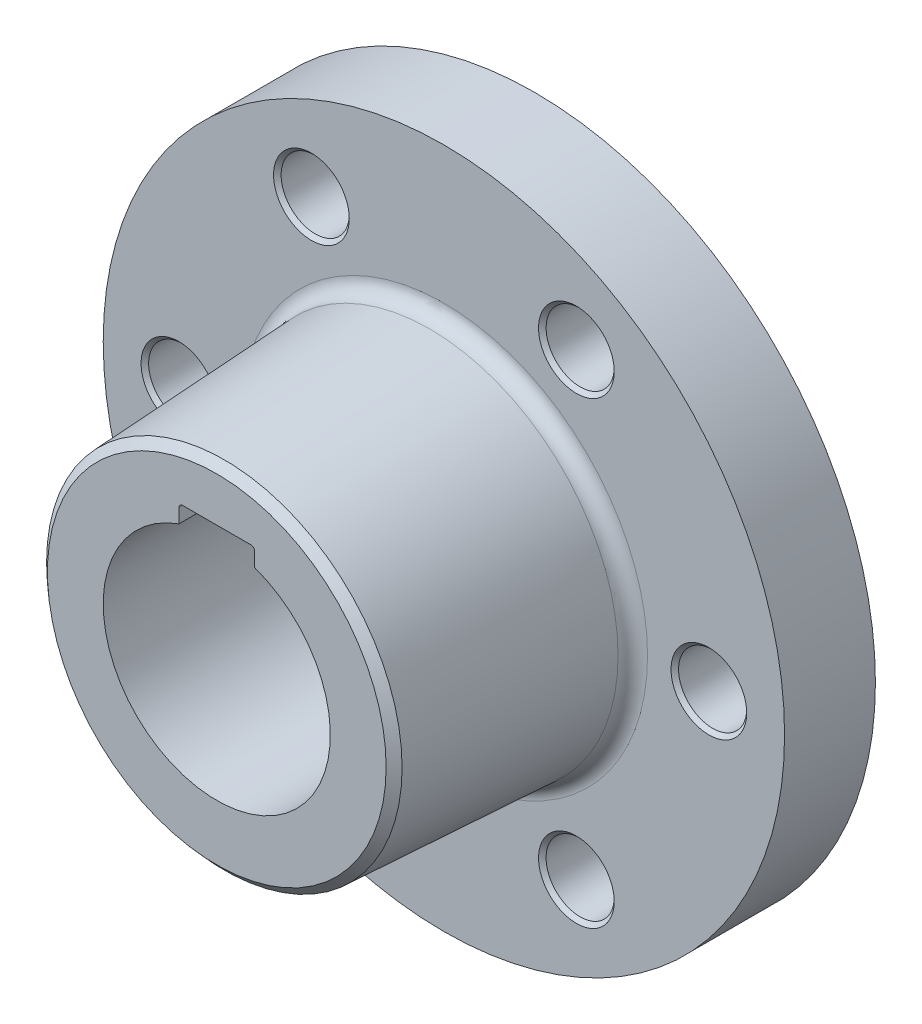
ISO-10303-21;
HEADER;
FILE_DESCRIPTION(('STEP AP214'),'2;1');
FILE_NAME('part.step','',(''),(''),'','','');
FILE_SCHEMA(('AUTOMOTIVE_DESIGN { 1 0 10303 214 1 1 1 1 }'));
ENDSEC;
DATA;
#1=APPLICATION_CONTEXT('core data for automotive mechanical design processes');
#2=APPLICATION_PROTOCOL_DEFINITION('international standard','automotive_design',2000,#1);
#3=PRODUCT_CONTEXT('',#1,'mechanical');
#4=PRODUCT('Part','Part','',(#3));
#5=PRODUCT_RELATED_PRODUCT_CATEGORY('part','',(#4));
#6=PRODUCT_DEFINITION_FORMATION('','',#4);
#7=PRODUCT_DEFINITION_CONTEXT('part definition',#1,'design');
#8=PRODUCT_DEFINITION('design','',#6,#7);
#9=PRODUCT_DEFINITION_SHAPE('','',#8);
#10=(LENGTH_UNIT() NAMED_UNIT(*) SI_UNIT(.MILLI.,.METRE.));
#11=(NAMED_UNIT(*) PLANE_ANGLE_UNIT() SI_UNIT($,.RADIAN.));
#12=(NAMED_UNIT(*) SI_UNIT($,.STERADIAN.) SOLID_ANGLE_UNIT());
#13=UNCERTAINTY_MEASURE_WITH_UNIT(LENGTH_MEASURE(1.E-05),#10,'distance_accuracy_value','');
#14=(GEOMETRIC_REPRESENTATION_CONTEXT(3) GLOBAL_UNCERTAINTY_ASSIGNED_CONTEXT((#13)) GLOBAL_UNIT_ASSIGNED_CONTEXT((#10,
#11,#12)) REPRESENTATION_CONTEXT('',''));
#15=CARTESIAN_POINT('',(0.,0.,0.));
#16=DIRECTION('',(0.,0.,1.));
#17=DIRECTION('',(1.,0.,0.));
#18=AXIS2_PLACEMENT_3D('',#15,#16,#17);
#19=CARTESIAN_POINT('',(0.,0.,12.));
#20=DIRECTION('',(0.,0.,-1.));
#21=DIRECTION('',(-1.,0.,0.));
#22=AXIS2_PLACEMENT_3D('',#19,#20,#21);
#23=CYLINDRICAL_SURFACE('',#22,45.);
#24=CARTESIAN_POINT('',(0.,0.,12.));
#25=DIRECTION('',(0.,0.,1.));
#26=DIRECTION('',(1.,0.,0.));
#27=AXIS2_PLACEMENT_3D('',#24,#25,#26);
#28=CIRCLE('',#27,45.);
#29=CARTESIAN_POINT('',(45.,0.,12.));
#30=VERTEX_POINT('',#29);
#31=EDGE_CURVE('E121',#30,#30,#28,.T.);
#32=ORIENTED_EDGE('',*,*,#31,.F.);
#33=EDGE_LOOP('',(#32));
#34=FACE_BOUND('',#33,.T.);
#35=CARTESIAN_POINT('',(0.,0.,0.));
#36=DIRECTION('',(0.,0.,1.));
#37=DIRECTION('',(1.,0.,0.));
#38=AXIS2_PLACEMENT_3D('',#35,#36,#37);
#39=CIRCLE('',#38,45.);
#40=CARTESIAN_POINT('',(45.,0.,0.));
#41=VERTEX_POINT('',#40);
#42=EDGE_CURVE('E115',#41,#41,#39,.T.);
#43=ORIENTED_EDGE('',*,*,#42,.T.);
#44=EDGE_LOOP('',(#43));
#45=FACE_BOUND('',#44,.T.);
#46=ADVANCED_FACE('F34',(#34,#45),#23,.T.);
#47=CARTESIAN_POINT('',(0.,0.,12.));
#48=DIRECTION('',(0.,0.,1.));
#49=DIRECTION('',(1.,0.,0.));
#50=AXIS2_PLACEMENT_3D('',#47,#48,#49);
#51=PLANE('',#50);
#52=CARTESIAN_POINT('',(17.5000000000004,-30.3108891324552,12.));
#53=DIRECTION('',(0.,0.,1.));
#54=DIRECTION('',(1.,0.,0.));
#55=AXIS2_PLACEMENT_3D('',#52,#53,#54);
#56=CIRCLE('',#55,5.00000000000001);
#57=CARTESIAN_POINT('',(22.5000000000004,-30.3108891324552,12.));
#58=VERTEX_POINT('',#57);
#59=EDGE_CURVE('E165',#58,#58,#56,.F.);
#60=ORIENTED_EDGE('',*,*,#59,.T.);
#61=EDGE_LOOP('',(#60));
#62=FACE_BOUND('',#61,.T.);
#63=CARTESIAN_POINT('',(-17.4999999999997,-30.3108891324555,12.));
#64=DIRECTION('',(0.,0.,1.));
#65=DIRECTION('',(1.,0.,0.));
#66=AXIS2_PLACEMENT_3D('',#63,#64,#65);
#67=CIRCLE('',#66,5.00000000000003);
#68=CARTESIAN_POINT('',(-12.4999999999997,-30.3108891324555,12.));
#69=VERTEX_POINT('',#68);
#70=EDGE_CURVE('E159',#69,#69,#67,.F.);
#71=ORIENTED_EDGE('',*,*,#70,.T.);
#72=EDGE_LOOP('',(#71));
#73=FACE_BOUND('',#72,.T.);
#74=CARTESIAN_POINT('',(-35.,0.,12.));
#75=DIRECTION('',(0.,0.,1.));
#76=DIRECTION('',(1.,0.,0.));
#77=AXIS2_PLACEMENT_3D('',#74,#75,#76);
#78=CIRCLE('',#77,5.);
#79=CARTESIAN_POINT('',(-30.,0.,12.));
#80=VERTEX_POINT('',#79);
#81=EDGE_CURVE('E153',#80,#80,#78,.F.);
#82=ORIENTED_EDGE('',*,*,#81,.T.);
#83=EDGE_LOOP('',(#82));
#84=FACE_BOUND('',#83,.T.);
#85=CARTESIAN_POINT('',(-17.5000000000001,30.3108891324553,12.));
#86=DIRECTION('',(0.,0.,1.));
#87=DIRECTION('',(1.,0.,0.));
#88=AXIS2_PLACEMENT_3D('',#85,#86,#87);
#89=CIRCLE('',#88,5.00000000000002);
#90=CARTESIAN_POINT('',(-12.5000000000001,30.3108891324553,12.));
#91=VERTEX_POINT('',#90);
#92=EDGE_CURVE('E147',#91,#91,#89,.F.);
#93=ORIENTED_EDGE('',*,*,#92,.T.);
#94=EDGE_LOOP('',(#93));
#95=FACE_BOUND('',#94,.T.);
#96=CARTESIAN_POINT('',(17.4999999999999,30.3108891324554,12.));
#97=DIRECTION('',(0.,0.,1.));
#98=DIRECTION('',(1.,0.,0.));
#99=AXIS2_PLACEMENT_3D('',#96,#97,#98);
#100=CIRCLE('',#99,5.);
#101=CARTESIAN_POINT('',(22.4999999999999,30.3108891324554,12.));
#102=VERTEX_POINT('',#101);
#103=EDGE_CURVE('E141',#102,#102,#100,.F.);
#104=ORIENTED_EDGE('',*,*,#103,.T.);
#105=EDGE_LOOP('',(#104));
#106=FACE_BOUND('',#105,.T.);
#107=CARTESIAN_POINT('',(35.,0.,12.));
#108=DIRECTION('',(0.,0.,1.));
#109=DIRECTION('',(1.,0.,0.));
#110=AXIS2_PLACEMENT_3D('',#107,#108,#109);
#111=CIRCLE('',#110,5.);
#112=CARTESIAN_POINT('',(40.,0.,12.));
#113=VERTEX_POINT('',#112);
#114=EDGE_CURVE('E135',#113,#113,#111,.F.);
#115=ORIENTED_EDGE('',*,*,#114,.T.);
#116=EDGE_LOOP('',(#115));
#117=FACE_BOUND('',#116,.T.);
#118=CARTESIAN_POINT('',(0.,0.,12.));
#119=DIRECTION('',(0.,0.,1.));
#120=DIRECTION('',(1.,0.,0.));
#121=AXIS2_PLACEMENT_3D('',#118,#119,#120);
#122=CIRCLE('',#121,26.8979291334298);
#123=CARTESIAN_POINT('',(26.8979291334298,0.,12.));
#124=VERTEX_POINT('',#123);
#125=EDGE_CURVE('E129',#124,#124,#122,.F.);
#126=ORIENTED_EDGE('',*,*,#125,.T.);
#127=EDGE_LOOP('',(#126));
#128=FACE_BOUND('',#127,.T.);
#129=ORIENTED_EDGE('',*,*,#31,.T.);
#130=EDGE_LOOP('',(#129));
#131=FACE_BOUND('',#130,.T.);
#132=ADVANCED_FACE('F194',(#62,#73,#84,#95,#106,#117,#128,#131),#51,.T.);
#133=CARTESIAN_POINT('',(0.,0.,0.));
#134=DIRECTION('',(0.,0.,1.));
#135=DIRECTION('',(1.,0.,0.));
#136=AXIS2_PLACEMENT_3D('',#133,#134,#135);
#137=PLANE('',#136);
#138=CARTESIAN_POINT('',(17.5000000000004,-30.3108891324552,0.));
#139=DIRECTION('',(0.,0.,1.));
#140=DIRECTION('',(1.,0.,0.));
#141=AXIS2_PLACEMENT_3D('',#138,#139,#140);
#142=CIRCLE('',#141,4.5);
#143=CARTESIAN_POINT('',(22.0000000000004,-30.3108891324552,0.));
#144=VERTEX_POINT('',#143);
#145=EDGE_CURVE('E266',#144,#144,#142,.F.);
#146=ORIENTED_EDGE('',*,*,#145,.F.);
#147=EDGE_LOOP('',(#146));
#148=FACE_BOUND('',#147,.T.);
#149=CARTESIAN_POINT('',(-17.4999999999997,-30.3108891324555,0.));
#150=DIRECTION('',(0.,0.,1.));
#151=DIRECTION('',(1.,0.,0.));
#152=AXIS2_PLACEMENT_3D('',#149,#150,#151);
#153=CIRCLE('',#152,4.5);
#154=CARTESIAN_POINT('',(-12.9999999999997,-30.3108891324555,0.));
#155=VERTEX_POINT('',#154);
#156=EDGE_CURVE('E269',#155,#155,#153,.F.);
#157=ORIENTED_EDGE('',*,*,#156,.F.);
#158=EDGE_LOOP('',(#157));
#159=FACE_BOUND('',#158,.T.);
#160=CARTESIAN_POINT('',(-35.,0.,0.));
#161=DIRECTION('',(0.,0.,1.));
#162=DIRECTION('',(1.,0.,0.));
#163=AXIS2_PLACEMENT_3D('',#160,#161,#162);
#164=CIRCLE('',#163,4.5);
#165=CARTESIAN_POINT('',(-30.5,0.,0.));
#166=VERTEX_POINT('',#165);
#167=EDGE_CURVE('E272',#166,#166,#164,.F.);
#168=ORIENTED_EDGE('',*,*,#167,.F.);
#169=EDGE_LOOP('',(#168));
#170=FACE_BOUND('',#169,.T.);
#171=CARTESIAN_POINT('',(-17.5000000000001,30.3108891324553,0.));
#172=DIRECTION('',(0.,0.,1.));
#173=DIRECTION('',(1.,0.,0.));
#174=AXIS2_PLACEMENT_3D('',#171,#172,#173);
#175=CIRCLE('',#174,4.5);
#176=CARTESIAN_POINT('',(-13.0000000000001,30.3108891324553,0.));
#177=VERTEX_POINT('',#176);
#178=EDGE_CURVE('E265',#177,#177,#175,.F.);
#179=ORIENTED_EDGE('',*,*,#178,.F.);
#180=EDGE_LOOP('',(#179));
#181=FACE_BOUND('',#180,.T.);
#182=CARTESIAN_POINT('',(17.4999999999999,30.3108891324554,0.));
#183=DIRECTION('',(0.,0.,1.));
#184=DIRECTION('',(1.,0.,0.));
#185=AXIS2_PLACEMENT_3D('',#182,#183,#184);
#186=CIRCLE('',#185,4.5);
#187=CARTESIAN_POINT('',(21.9999999999999,30.3108891324554,0.));
#188=VERTEX_POINT('',#187);
#189=EDGE_CURVE('E260',#188,#188,#186,.F.);
#190=ORIENTED_EDGE('',*,*,#189,.F.);
#191=EDGE_LOOP('',(#190));
#192=FACE_BOUND('',#191,.T.);
#193=CARTESIAN_POINT('',(35.,0.,0.));
#194=DIRECTION('',(0.,0.,1.));
#195=DIRECTION('',(1.,0.,0.));
#196=AXIS2_PLACEMENT_3D('',#193,#194,#195);
#197=CIRCLE('',#196,4.5);
#198=CARTESIAN_POINT('',(39.5,0.,0.));
#199=VERTEX_POINT('',#198);
#200=EDGE_CURVE('E258',#199,#199,#197,.F.);
#201=ORIENTED_EDGE('',*,*,#200,.F.);
#202=EDGE_LOOP('',(#201));
#203=FACE_BOUND('',#202,.T.);
#204=DIRECTION('',(1.,0.,0.));
#205=VECTOR('',#204,1.);
#206=CARTESIAN_POINT('',(-5.,16.5,0.));
#207=LINE('',#206,#205);
#208=CARTESIAN_POINT('',(-4.5,16.5,0.));
#209=VERTEX_POINT('',#208);
#210=CARTESIAN_POINT('',(4.5,16.5,0.));
#211=VERTEX_POINT('',#210);
#212=EDGE_CURVE('E107',#209,#211,#207,.T.);
#213=ORIENTED_EDGE('',*,*,#212,.F.);
#214=CARTESIAN_POINT('',(-4.5,16.,0.));
#215=DIRECTION('',(0.,0.,1.));
#216=DIRECTION('',(1.,0.,0.));
#217=AXIS2_PLACEMENT_3D('',#214,#215,#216);
#218=CIRCLE('',#217,0.5);
#219=CARTESIAN_POINT('',(-5.,16.,0.));
#220=VERTEX_POINT('',#219);
#221=EDGE_CURVE('E57',#209,#220,#218,.T.);
#222=ORIENTED_EDGE('',*,*,#221,.T.);
#223=DIRECTION('',(0.,1.,0.));
#224=VECTOR('',#223,1.);
#225=CARTESIAN_POINT('',(-5.,13.1290127956157,0.));
#226=LINE('',#225,#224);
#227=CARTESIAN_POINT('',(-5.,14.142135623731,0.));
#228=VERTEX_POINT('',#227);
#229=EDGE_CURVE('E97',#228,#220,#226,.T.);
#230=ORIENTED_EDGE('',*,*,#229,.F.);
#231=CARTESIAN_POINT('',(0.,0.,0.));
#232=DIRECTION('',(0.,0.,1.));
#233=DIRECTION('',(1.,0.,0.));
#234=AXIS2_PLACEMENT_3D('',#231,#232,#233);
#235=CIRCLE('',#234,15.);
#236=CARTESIAN_POINT('',(5.,14.1421356237309,0.));
#237=VERTEX_POINT('',#236);
#238=EDGE_CURVE('E106',#237,#228,#235,.F.);
#239=ORIENTED_EDGE('',*,*,#238,.F.);
#240=DIRECTION('',(0.,-1.,0.));
#241=VECTOR('',#240,1.);
#242=CARTESIAN_POINT('',(5.,16.5,0.));
#243=LINE('',#242,#241);
#244=CARTESIAN_POINT('',(5.,16.,0.));
#245=VERTEX_POINT('',#244);
#246=EDGE_CURVE('E113',#245,#237,#243,.T.);
#247=ORIENTED_EDGE('',*,*,#246,.F.);
#248=CARTESIAN_POINT('',(4.5,16.,0.));
#249=DIRECTION('',(0.,0.,1.));
#250=DIRECTION('',(1.,0.,0.));
#251=AXIS2_PLACEMENT_3D('',#248,#249,#250);
#252=CIRCLE('',#251,0.5);
#253=EDGE_CURVE('E178',#245,#211,#252,.T.);
#254=ORIENTED_EDGE('',*,*,#253,.T.);
#255=EDGE_LOOP('',(#213,#222,#230,#239,#247,#254));
#256=FACE_BOUND('',#255,.T.);
#257=ORIENTED_EDGE('',*,*,#42,.F.);
#258=EDGE_LOOP('',(#257));
#259=FACE_BOUND('',#258,.T.);
#260=ADVANCED_FACE('F200',(#148,#159,#170,#181,#192,#203,#256,#259),#137,.F.);
#261=CARTESIAN_POINT('',(0.,0.,12.));
#262=DIRECTION('',(0.,0.,-1.));
#263=DIRECTION('',(1.,0.,0.));
#264=AXIS2_PLACEMENT_3D('',#261,#262,#263);
#265=CONICAL_SURFACE('',#264,25.,0.05235987755983);
#266=CARTESIAN_POINT('',(0.,0.,41.0013704652454));
#267=DIRECTION('',(0.,0.,-1.));
#268=DIRECTION('',(-1.,0.,0.));
#269=AXIS2_PLACEMENT_3D('',#266,#267,#268);
#270=CIRCLE('',#269,23.4801025777517);
#271=CARTESIAN_POINT('',(-23.4801025777517,0.,41.0013704652454));
#272=VERTEX_POINT('',#271);
#273=EDGE_CURVE('E11',#272,#272,#270,.T.);
#274=ORIENTED_EDGE('',*,*,#273,.T.);
#275=EDGE_LOOP('',(#274));
#276=FACE_BOUND('',#275,.T.);
#277=CARTESIAN_POINT('',(0.,0.,13.8953280875141));
#278=DIRECTION('',(0.,0.,1.));
#279=DIRECTION('',(1.,0.,0.));
#280=AXIS2_PLACEMENT_3D('',#277,#278,#279);
#281=CIRCLE('',#280,24.9006700639206);
#282=CARTESIAN_POINT('',(24.9006700639206,0.,13.8953280875141));
#283=VERTEX_POINT('',#282);
#284=EDGE_CURVE('E124',#283,#283,#281,.T.);
#285=ORIENTED_EDGE('',*,*,#284,.T.);
#286=EDGE_LOOP('',(#285));
#287=FACE_BOUND('',#286,.T.);
#288=ADVANCED_FACE('F282',(#276,#287),#265,.T.);
#289=CARTESIAN_POINT('',(0.,0.,42.));
#290=DIRECTION('',(0.,0.,1.));
#291=DIRECTION('',(1.,0.,0.));
#292=AXIS2_PLACEMENT_3D('',#289,#290,#291);
#293=PLANE('',#292);
#294=CARTESIAN_POINT('',(0.,0.,42.));
#295=DIRECTION('',(0.,0.,1.));
#296=DIRECTION('',(1.,0.,0.));
#297=AXIS2_PLACEMENT_3D('',#294,#295,#296);
#298=CIRCLE('',#297,22.3710121187752);
#299=CARTESIAN_POINT('',(22.3710121187752,0.,42.));
#300=VERTEX_POINT('',#299);
#301=EDGE_CURVE('E42',#300,#300,#298,.T.);
#302=ORIENTED_EDGE('',*,*,#301,.T.);
#303=EDGE_LOOP('',(#302));
#304=FACE_BOUND('',#303,.T.);
#305=DIRECTION('',(0.,-1.,0.));
#306=VECTOR('',#305,1.);
#307=CARTESIAN_POINT('',(-5.,13.1290127956157,42.));
#308=LINE('',#307,#306);
#309=CARTESIAN_POINT('',(-5.,16.,42.));
#310=VERTEX_POINT('',#309);
#311=CARTESIAN_POINT('',(-5.,14.142135623731,42.));
#312=VERTEX_POINT('',#311);
#313=EDGE_CURVE('E89',#310,#312,#308,.T.);
#314=ORIENTED_EDGE('',*,*,#313,.F.);
#315=CARTESIAN_POINT('',(-4.5,16.,42.));
#316=DIRECTION('',(0.,0.,1.));
#317=DIRECTION('',(1.,0.,0.));
#318=AXIS2_PLACEMENT_3D('',#315,#316,#317);
#319=CIRCLE('',#318,0.5);
#320=CARTESIAN_POINT('',(-4.5,16.5,42.));
#321=VERTEX_POINT('',#320);
#322=EDGE_CURVE('E49',#310,#321,#319,.F.);
#323=ORIENTED_EDGE('',*,*,#322,.T.);
#324=DIRECTION('',(-1.,0.,0.));
#325=VECTOR('',#324,1.);
#326=CARTESIAN_POINT('',(-5.,16.5,42.));
#327=LINE('',#326,#325);
#328=CARTESIAN_POINT('',(4.5,16.5,42.));
#329=VERTEX_POINT('',#328);
#330=EDGE_CURVE('E117',#329,#321,#327,.T.);
#331=ORIENTED_EDGE('',*,*,#330,.F.);
#332=CARTESIAN_POINT('',(4.5,16.,42.));
#333=DIRECTION('',(0.,0.,1.));
#334=DIRECTION('',(1.,0.,0.));
#335=AXIS2_PLACEMENT_3D('',#332,#333,#334);
#336=CIRCLE('',#335,0.5);
#337=CARTESIAN_POINT('',(5.,16.,42.));
#338=VERTEX_POINT('',#337);
#339=EDGE_CURVE('E176',#329,#338,#336,.F.);
#340=ORIENTED_EDGE('',*,*,#339,.T.);
#341=DIRECTION('',(0.,1.,0.));
#342=VECTOR('',#341,1.);
#343=CARTESIAN_POINT('',(5.,16.5,42.));
#344=LINE('',#343,#342);
#345=CARTESIAN_POINT('',(5.,14.1421356237309,42.));
#346=VERTEX_POINT('',#345);
#347=EDGE_CURVE('E96',#346,#338,#344,.T.);
#348=ORIENTED_EDGE('',*,*,#347,.F.);
#349=CARTESIAN_POINT('',(0.,0.,42.));
#350=DIRECTION('',(0.,0.,1.));
#351=DIRECTION('',(1.,0.,0.));
#352=AXIS2_PLACEMENT_3D('',#349,#350,#351);
#353=CIRCLE('',#352,15.);
#354=EDGE_CURVE('E104',#312,#346,#353,.T.);
#355=ORIENTED_EDGE('',*,*,#354,.F.);
#356=EDGE_LOOP('',(#314,#323,#331,#340,#348,#355));
#357=FACE_BOUND('',#356,.T.);
#358=ADVANCED_FACE('F111',(#304,#357),#293,.T.);
#359=CARTESIAN_POINT('',(0.,0.,-0.001000000000001));
#360=DIRECTION('',(0.,0.,1.));
#361=DIRECTION('',(1.,0.,0.));
#362=AXIS2_PLACEMENT_3D('',#359,#360,#361);
#363=CYLINDRICAL_SURFACE('',#362,15.);
#364=ORIENTED_EDGE('',*,*,#238,.T.);
#365=DIRECTION('',(0.,0.,1.));
#366=VECTOR('',#365,1.);
#367=CARTESIAN_POINT('',(-5.,14.142135623731,-0.001000000000001));
#368=LINE('',#367,#366);
#369=EDGE_CURVE('E92',#312,#228,#368,.F.);
#370=ORIENTED_EDGE('',*,*,#369,.F.);
#371=ORIENTED_EDGE('',*,*,#354,.T.);
#372=DIRECTION('',(0.,0.,1.));
#373=VECTOR('',#372,1.);
#374=CARTESIAN_POINT('',(5.,14.1421356237309,-0.001000000000001));
#375=LINE('',#374,#373);
#376=EDGE_CURVE('E108',#237,#346,#375,.T.);
#377=ORIENTED_EDGE('',*,*,#376,.F.);
#378=EDGE_LOOP('',(#364,#370,#371,#377));
#379=FACE_BOUND('',#378,.T.);
#380=ADVANCED_FACE('F102',(#379),#363,.F.);
#381=CARTESIAN_POINT('',(-5.,13.1290127956157,-0.001000000000001));
#382=DIRECTION('',(-1.,0.,0.));
#383=DIRECTION('',(0.,0.,1.));
#384=AXIS2_PLACEMENT_3D('',#381,#382,#383);
#385=PLANE('',#384);
#386=ORIENTED_EDGE('',*,*,#229,.T.);
#387=DIRECTION('',(0.,0.,1.));
#388=VECTOR('',#387,1.);
#389=CARTESIAN_POINT('',(-5.,16.,42.));
#390=LINE('',#389,#388);
#391=EDGE_CURVE('E93',#220,#310,#390,.T.);
#392=ORIENTED_EDGE('',*,*,#391,.T.);
#393=ORIENTED_EDGE('',*,*,#313,.T.);
#394=ORIENTED_EDGE('',*,*,#369,.T.);
#395=EDGE_LOOP('',(#386,#392,#393,#394));
#396=FACE_BOUND('',#395,.T.);
#397=ADVANCED_FACE('F91',(#396),#385,.F.);
#398=CARTESIAN_POINT('',(-5.,16.5,-0.001000000000001));
#399=DIRECTION('',(0.,1.,0.));
#400=DIRECTION('',(0.,0.,1.));
#401=AXIS2_PLACEMENT_3D('',#398,#399,#400);
#402=PLANE('',#401);
#403=ORIENTED_EDGE('',*,*,#212,.T.);
#404=DIRECTION('',(0.,0.,1.));
#405=VECTOR('',#404,1.);
#406=CARTESIAN_POINT('',(4.5,16.5,42.));
#407=LINE('',#406,#405);
#408=EDGE_CURVE('E170',#211,#329,#407,.T.);
#409=ORIENTED_EDGE('',*,*,#408,.T.);
#410=ORIENTED_EDGE('',*,*,#330,.T.);
#411=DIRECTION('',(0.,0.,1.));
#412=VECTOR('',#411,1.);
#413=CARTESIAN_POINT('',(-4.5,16.5,0.));
#414=LINE('',#413,#412);
#415=EDGE_CURVE('E168',#321,#209,#414,.F.);
#416=ORIENTED_EDGE('',*,*,#415,.T.);
#417=EDGE_LOOP('',(#403,#409,#410,#416));
#418=FACE_BOUND('',#417,.T.);
#419=ADVANCED_FACE('F250',(#418),#402,.F.);
#420=CARTESIAN_POINT('',(5.,16.5,-0.001000000000001));
#421=DIRECTION('',(1.,0.,0.));
#422=DIRECTION('',(0.,1.,0.));
#423=AXIS2_PLACEMENT_3D('',#420,#421,#422);
#424=PLANE('',#423);
#425=ORIENTED_EDGE('',*,*,#347,.T.);
#426=DIRECTION('',(0.,0.,1.));
#427=VECTOR('',#426,1.);
#428=CARTESIAN_POINT('',(5.,16.,0.));
#429=LINE('',#428,#427);
#430=EDGE_CURVE('E173',#338,#245,#429,.F.);
#431=ORIENTED_EDGE('',*,*,#430,.T.);
#432=ORIENTED_EDGE('',*,*,#246,.T.);
#433=ORIENTED_EDGE('',*,*,#376,.T.);
#434=EDGE_LOOP('',(#425,#431,#432,#433));
#435=FACE_BOUND('',#434,.T.);
#436=ADVANCED_FACE('F211',(#435),#424,.F.);
#437=CARTESIAN_POINT('',(0.,0.,14.));
#438=DIRECTION('',(0.,0.,1.));
#439=DIRECTION('',(1.,0.,0.));
#440=AXIS2_PLACEMENT_3D('',#437,#438,#439);
#441=TOROIDAL_SURFACE('',#440,26.8979291334298,2.);
#442=ORIENTED_EDGE('',*,*,#125,.F.);
#443=EDGE_LOOP('',(#442));
#444=FACE_BOUND('',#443,.T.);
#445=ORIENTED_EDGE('',*,*,#284,.F.);
#446=EDGE_LOOP('',(#445));
#447=FACE_BOUND('',#446,.T.);
#448=ADVANCED_FACE('F207',(#444,#447),#441,.F.);
#449=CARTESIAN_POINT('',(35.,0.,-0.000999999999999265));
#450=DIRECTION('',(0.,0.,1.));
#451=DIRECTION('',(1.,0.,0.));
#452=AXIS2_PLACEMENT_3D('',#449,#450,#451);
#453=CYLINDRICAL_SURFACE('',#452,4.5);
#454=CARTESIAN_POINT('',(35.,0.,11.5));
#455=DIRECTION('',(0.,0.,1.));
#456=DIRECTION('',(1.,0.,0.));
#457=AXIS2_PLACEMENT_3D('',#454,#455,#456);
#458=CIRCLE('',#457,4.5);
#459=CARTESIAN_POINT('',(39.5,0.,11.5));
#460=VERTEX_POINT('',#459);
#461=EDGE_CURVE('E132',#460,#460,#458,.T.);
#462=ORIENTED_EDGE('',*,*,#461,.T.);
#463=EDGE_LOOP('',(#462));
#464=FACE_BOUND('',#463,.T.);
#465=ORIENTED_EDGE('',*,*,#200,.T.);
#466=EDGE_LOOP('',(#465));
#467=FACE_BOUND('',#466,.T.);
#468=ADVANCED_FACE('F210',(#464,#467),#453,.F.);
#469=CARTESIAN_POINT('',(35.,0.,11.5));
#470=DIRECTION('',(0.,0.,1.));
#471=DIRECTION('',(1.,0.,0.));
#472=AXIS2_PLACEMENT_3D('',#469,#470,#471);
#473=CONICAL_SURFACE('',#472,4.5,0.785398163397447);
#474=ORIENTED_EDGE('',*,*,#114,.F.);
#475=EDGE_LOOP('',(#474));
#476=FACE_BOUND('',#475,.T.);
#477=ORIENTED_EDGE('',*,*,#461,.F.);
#478=EDGE_LOOP('',(#477));
#479=FACE_BOUND('',#478,.T.);
#480=ADVANCED_FACE('F213',(#476,#479),#473,.F.);
#481=CARTESIAN_POINT('',(17.4999999999999,30.3108891324554,-0.000999999999999265));
#482=DIRECTION('',(0.,0.,1.));
#483=DIRECTION('',(1.,0.,0.));
#484=AXIS2_PLACEMENT_3D('',#481,#482,#483);
#485=CYLINDRICAL_SURFACE('',#484,4.5);
#486=CARTESIAN_POINT('',(17.4999999999999,30.3108891324554,11.5));
#487=DIRECTION('',(0.,0.,1.));
#488=DIRECTION('',(1.,0.,0.));
#489=AXIS2_PLACEMENT_3D('',#486,#487,#488);
#490=CIRCLE('',#489,4.5);
#491=CARTESIAN_POINT('',(21.9999999999999,30.3108891324554,11.5));
#492=VERTEX_POINT('',#491);
#493=EDGE_CURVE('E138',#492,#492,#490,.T.);
#494=ORIENTED_EDGE('',*,*,#493,.T.);
#495=EDGE_LOOP('',(#494));
#496=FACE_BOUND('',#495,.T.);
#497=ORIENTED_EDGE('',*,*,#189,.T.);
#498=EDGE_LOOP('',(#497));
#499=FACE_BOUND('',#498,.T.);
#500=ADVANCED_FACE('F216',(#496,#499),#485,.F.);
#501=CARTESIAN_POINT('',(-17.5000000000001,30.3108891324553,-0.000999999999999265));
#502=DIRECTION('',(0.,0.,1.));
#503=DIRECTION('',(1.,0.,0.));
#504=AXIS2_PLACEMENT_3D('',#501,#502,#503);
#505=CYLINDRICAL_SURFACE('',#504,4.5);
#506=CARTESIAN_POINT('',(-17.5000000000001,30.3108891324553,11.5));
#507=DIRECTION('',(0.,0.,1.));
#508=DIRECTION('',(1.,0.,0.));
#509=AXIS2_PLACEMENT_3D('',#506,#507,#508);
#510=CIRCLE('',#509,4.5);
#511=CARTESIAN_POINT('',(-13.0000000000001,30.3108891324553,11.5));
#512=VERTEX_POINT('',#511);
#513=EDGE_CURVE('E144',#512,#512,#510,.T.);
#514=ORIENTED_EDGE('',*,*,#513,.T.);
#515=EDGE_LOOP('',(#514));
#516=FACE_BOUND('',#515,.T.);
#517=ORIENTED_EDGE('',*,*,#178,.T.);
#518=EDGE_LOOP('',(#517));
#519=FACE_BOUND('',#518,.T.);
#520=ADVANCED_FACE('F278',(#516,#519),#505,.F.);
#521=CARTESIAN_POINT('',(-35.,0.,-0.000999999999999265));
#522=DIRECTION('',(0.,0.,1.));
#523=DIRECTION('',(1.,0.,0.));
#524=AXIS2_PLACEMENT_3D('',#521,#522,#523);
#525=CYLINDRICAL_SURFACE('',#524,4.5);
#526=CARTESIAN_POINT('',(-35.,0.,11.5));
#527=DIRECTION('',(0.,0.,1.));
#528=DIRECTION('',(1.,0.,0.));
#529=AXIS2_PLACEMENT_3D('',#526,#527,#528);
#530=CIRCLE('',#529,4.5);
#531=CARTESIAN_POINT('',(-30.5,0.,11.5));
#532=VERTEX_POINT('',#531);
#533=EDGE_CURVE('E150',#532,#532,#530,.T.);
#534=ORIENTED_EDGE('',*,*,#533,.T.);
#535=EDGE_LOOP('',(#534));
#536=FACE_BOUND('',#535,.T.);
#537=ORIENTED_EDGE('',*,*,#167,.T.);
#538=EDGE_LOOP('',(#537));
#539=FACE_BOUND('',#538,.T.);
#540=ADVANCED_FACE('F375',(#536,#539),#525,.F.);
#541=CARTESIAN_POINT('',(-17.4999999999997,-30.3108891324555,-0.000999999999999265));
#542=DIRECTION('',(0.,0.,1.));
#543=DIRECTION('',(1.,0.,0.));
#544=AXIS2_PLACEMENT_3D('',#541,#542,#543);
#545=CYLINDRICAL_SURFACE('',#544,4.5);
#546=CARTESIAN_POINT('',(-17.4999999999997,-30.3108891324555,11.5));
#547=DIRECTION('',(0.,0.,1.));
#548=DIRECTION('',(1.,0.,0.));
#549=AXIS2_PLACEMENT_3D('',#546,#547,#548);
#550=CIRCLE('',#549,4.5);
#551=CARTESIAN_POINT('',(-12.9999999999997,-30.3108891324555,11.5));
#552=VERTEX_POINT('',#551);
#553=EDGE_CURVE('E156',#552,#552,#550,.T.);
#554=ORIENTED_EDGE('',*,*,#553,.T.);
#555=EDGE_LOOP('',(#554));
#556=FACE_BOUND('',#555,.T.);
#557=ORIENTED_EDGE('',*,*,#156,.T.);
#558=EDGE_LOOP('',(#557));
#559=FACE_BOUND('',#558,.T.);
#560=ADVANCED_FACE('F385',(#556,#559),#545,.F.);
#561=CARTESIAN_POINT('',(17.5000000000004,-30.3108891324552,-0.000999999999999265));
#562=DIRECTION('',(0.,0.,1.));
#563=DIRECTION('',(1.,0.,0.));
#564=AXIS2_PLACEMENT_3D('',#561,#562,#563);
#565=CYLINDRICAL_SURFACE('',#564,4.5);
#566=CARTESIAN_POINT('',(17.5000000000004,-30.3108891324552,11.5));
#567=DIRECTION('',(0.,0.,1.));
#568=DIRECTION('',(1.,0.,0.));
#569=AXIS2_PLACEMENT_3D('',#566,#567,#568);
#570=CIRCLE('',#569,4.5);
#571=CARTESIAN_POINT('',(22.0000000000004,-30.3108891324552,11.5));
#572=VERTEX_POINT('',#571);
#573=EDGE_CURVE('E162',#572,#572,#570,.T.);
#574=ORIENTED_EDGE('',*,*,#573,.T.);
#575=EDGE_LOOP('',(#574));
#576=FACE_BOUND('',#575,.T.);
#577=ORIENTED_EDGE('',*,*,#145,.T.);
#578=EDGE_LOOP('',(#577));
#579=FACE_BOUND('',#578,.T.);
#580=ADVANCED_FACE('F222',(#576,#579),#565,.F.);
#581=CARTESIAN_POINT('',(17.4999999999999,30.3108891324554,11.5));
#582=DIRECTION('',(0.,0.,1.));
#583=DIRECTION('',(1.,0.,0.));
#584=AXIS2_PLACEMENT_3D('',#581,#582,#583);
#585=CONICAL_SURFACE('',#584,4.5,0.785398163397449);
#586=ORIENTED_EDGE('',*,*,#103,.F.);
#587=EDGE_LOOP('',(#586));
#588=FACE_BOUND('',#587,.T.);
#589=ORIENTED_EDGE('',*,*,#493,.F.);
#590=EDGE_LOOP('',(#589));
#591=FACE_BOUND('',#590,.T.);
#592=ADVANCED_FACE('F218',(#588,#591),#585,.F.);
#593=CARTESIAN_POINT('',(-17.5000000000001,30.3108891324553,11.5));
#594=DIRECTION('',(0.,0.,1.));
#595=DIRECTION('',(1.,0.,0.));
#596=AXIS2_PLACEMENT_3D('',#593,#594,#595);
#597=CONICAL_SURFACE('',#596,4.5,0.785398163397464);
#598=ORIENTED_EDGE('',*,*,#92,.F.);
#599=EDGE_LOOP('',(#598));
#600=FACE_BOUND('',#599,.T.);
#601=ORIENTED_EDGE('',*,*,#513,.F.);
#602=EDGE_LOOP('',(#601));
#603=FACE_BOUND('',#602,.T.);
#604=ADVANCED_FACE('F221',(#600,#603),#597,.F.);
#605=CARTESIAN_POINT('',(-35.,0.,11.5));
#606=DIRECTION('',(0.,0.,1.));
#607=DIRECTION('',(1.,0.,0.));
#608=AXIS2_PLACEMENT_3D('',#605,#606,#607);
#609=CONICAL_SURFACE('',#608,4.5,0.785398163397447);
#610=ORIENTED_EDGE('',*,*,#81,.F.);
#611=EDGE_LOOP('',(#610));
#612=FACE_BOUND('',#611,.T.);
#613=ORIENTED_EDGE('',*,*,#533,.F.);
#614=EDGE_LOOP('',(#613));
#615=FACE_BOUND('',#614,.T.);
#616=ADVANCED_FACE('F226',(#612,#615),#609,.F.);
#617=CARTESIAN_POINT('',(-17.4999999999997,-30.3108891324555,11.5));
#618=DIRECTION('',(0.,0.,1.));
#619=DIRECTION('',(1.,0.,0.));
#620=AXIS2_PLACEMENT_3D('',#617,#618,#619);
#621=CONICAL_SURFACE('',#620,4.5,0.785398163397448);
#622=ORIENTED_EDGE('',*,*,#70,.F.);
#623=EDGE_LOOP('',(#622));
#624=FACE_BOUND('',#623,.T.);
#625=ORIENTED_EDGE('',*,*,#553,.F.);
#626=EDGE_LOOP('',(#625));
#627=FACE_BOUND('',#626,.T.);
#628=ADVANCED_FACE('F230',(#624,#627),#621,.F.);
#629=CARTESIAN_POINT('',(17.5000000000004,-30.3108891324552,11.5));
#630=DIRECTION('',(0.,0.,1.));
#631=DIRECTION('',(1.,0.,0.));
#632=AXIS2_PLACEMENT_3D('',#629,#630,#631);
#633=CONICAL_SURFACE('',#632,4.5,0.785398163397451);
#634=ORIENTED_EDGE('',*,*,#59,.F.);
#635=EDGE_LOOP('',(#634));
#636=FACE_BOUND('',#635,.T.);
#637=ORIENTED_EDGE('',*,*,#573,.F.);
#638=EDGE_LOOP('',(#637));
#639=FACE_BOUND('',#638,.T.);
#640=ADVANCED_FACE('F234',(#636,#639),#633,.F.);
#641=CARTESIAN_POINT('',(4.5,16.,-0.001000000000001));
#642=DIRECTION('',(0.,0.,-1.));
#643=DIRECTION('',(-1.,0.,0.));
#644=AXIS2_PLACEMENT_3D('',#641,#642,#643);
#645=CYLINDRICAL_SURFACE('',#644,0.5);
#646=ORIENTED_EDGE('',*,*,#253,.F.);
#647=ORIENTED_EDGE('',*,*,#430,.F.);
#648=ORIENTED_EDGE('',*,*,#339,.F.);
#649=ORIENTED_EDGE('',*,*,#408,.F.);
#650=EDGE_LOOP('',(#646,#647,#648,#649));
#651=FACE_BOUND('',#650,.T.);
#652=ADVANCED_FACE('F191',(#651),#645,.F.);
#653=CARTESIAN_POINT('',(-4.5,16.,-0.001000000000001));
#654=DIRECTION('',(0.,0.,-1.));
#655=DIRECTION('',(-1.,0.,0.));
#656=AXIS2_PLACEMENT_3D('',#653,#654,#655);
#657=CYLINDRICAL_SURFACE('',#656,0.5);
#658=ORIENTED_EDGE('',*,*,#221,.F.);
#659=ORIENTED_EDGE('',*,*,#415,.F.);
#660=ORIENTED_EDGE('',*,*,#322,.F.);
#661=ORIENTED_EDGE('',*,*,#391,.F.);
#662=EDGE_LOOP('',(#658,#659,#660,#661));
#663=FACE_BOUND('',#662,.T.);
#664=ADVANCED_FACE('F186',(#663),#657,.F.);
#665=CARTESIAN_POINT('',(0.,0.,42.));
#666=DIRECTION('',(0.,0.,-1.));
#667=DIRECTION('',(-1.,0.,0.));
#668=AXIS2_PLACEMENT_3D('',#665,#666,#667);
#669=CONICAL_SURFACE('',#668,22.3710121187752,0.837758040957271);
#670=ORIENTED_EDGE('',*,*,#273,.F.);
#671=EDGE_LOOP('',(#670));
#672=FACE_BOUND('',#671,.T.);
#673=ORIENTED_EDGE('',*,*,#301,.F.);
#674=EDGE_LOOP('',(#673));
#675=FACE_BOUND('',#674,.T.);
#676=ADVANCED_FACE('F36',(#672,#675),#669,.T.);
#677=CLOSED_SHELL('',(#46,#132,#260,#288,#358,#380,#397,#419,#436,#448,#468,#480,#500,#520,#540,
#560,#580,#592,#604,#616,#628,#640,#652,#664,#676));
#678=MANIFOLD_SOLID_BREP('B2',#677);
#679=ADVANCED_BREP_SHAPE_REPRESENTATION('',(#18,#678),#14);
#680=SHAPE_DEFINITION_REPRESENTATION(#9,#679);
ENDSEC;
END-ISO-10303-21;
